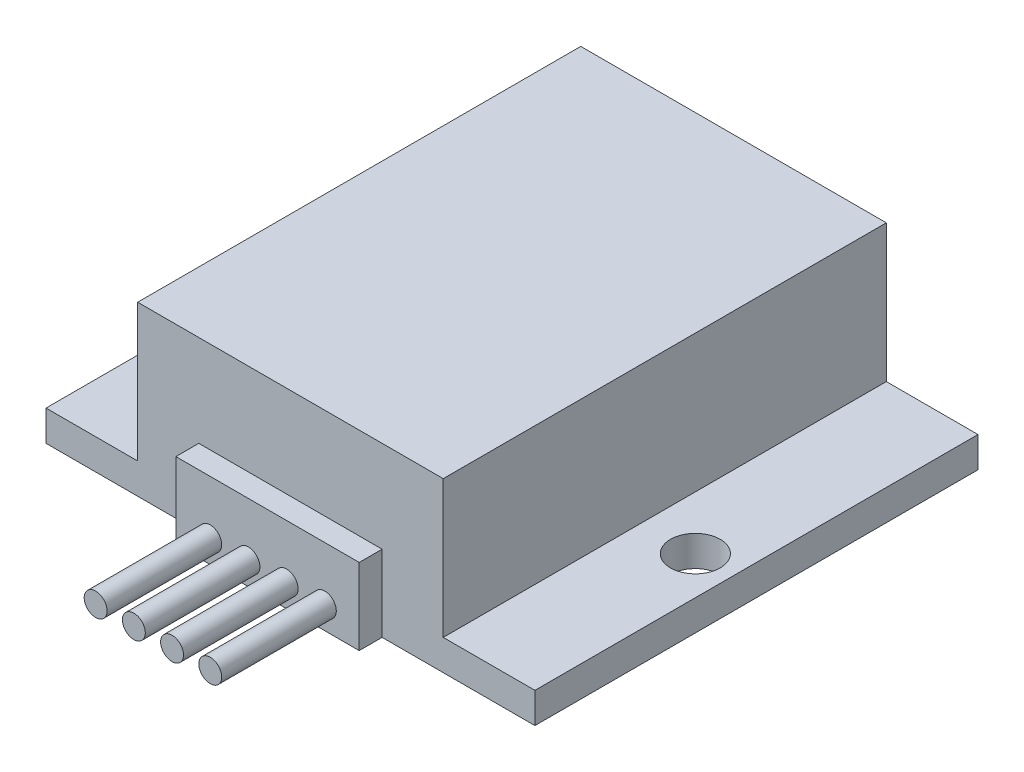
ISO-10303-21;
HEADER;
FILE_DESCRIPTION(('STEP AP214'),'2;1');
FILE_NAME('part.step','',(''),(''),'','','');
FILE_SCHEMA(('AUTOMOTIVE_DESIGN { 1 0 10303 214 1 1 1 1 }'));
ENDSEC;
DATA;
#1=APPLICATION_CONTEXT('core data for automotive mechanical design processes');
#2=APPLICATION_PROTOCOL_DEFINITION('international standard','automotive_design',2000,#1);
#3=PRODUCT_CONTEXT('',#1,'mechanical');
#4=PRODUCT('Part','Part','',(#3));
#5=PRODUCT_RELATED_PRODUCT_CATEGORY('part','',(#4));
#6=PRODUCT_DEFINITION_FORMATION('','',#4);
#7=PRODUCT_DEFINITION_CONTEXT('part definition',#1,'design');
#8=PRODUCT_DEFINITION('design','',#6,#7);
#9=PRODUCT_DEFINITION_SHAPE('','',#8);
#10=(LENGTH_UNIT() NAMED_UNIT(*) SI_UNIT(.MILLI.,.METRE.));
#11=(NAMED_UNIT(*) PLANE_ANGLE_UNIT() SI_UNIT($,.RADIAN.));
#12=(NAMED_UNIT(*) SI_UNIT($,.STERADIAN.) SOLID_ANGLE_UNIT());
#13=UNCERTAINTY_MEASURE_WITH_UNIT(LENGTH_MEASURE(1.E-05),#10,'distance_accuracy_value','');
#14=(GEOMETRIC_REPRESENTATION_CONTEXT(3) GLOBAL_UNCERTAINTY_ASSIGNED_CONTEXT((#13)) GLOBAL_UNIT_ASSIGNED_CONTEXT((#10,
#11,#12)) REPRESENTATION_CONTEXT('',''));
#15=CARTESIAN_POINT('',(0.,0.,0.));
#16=DIRECTION('',(0.,0.,1.));
#17=DIRECTION('',(1.,0.,0.));
#18=AXIS2_PLACEMENT_3D('',#15,#16,#17);
#19=CARTESIAN_POINT('',(0.,4.,29.));
#20=DIRECTION('',(0.,0.,-1.));
#21=DIRECTION('',(-1.,0.,0.));
#22=AXIS2_PLACEMENT_3D('',#19,#20,#21);
#23=PLANE('',#22);
#24=DIRECTION('',(0.,-1.,0.));
#25=VECTOR('',#24,1.);
#26=CARTESIAN_POINT('',(-12.,10.,29.));
#27=LINE('',#26,#25);
#28=CARTESIAN_POINT('',(-12.,10.,29.));
#29=VERTEX_POINT('',#28);
#30=CARTESIAN_POINT('',(-12.,0.,29.));
#31=VERTEX_POINT('',#30);
#32=EDGE_CURVE('E161',#29,#31,#27,.T.);
#33=ORIENTED_EDGE('',*,*,#32,.F.);
#34=DIRECTION('',(1.,0.,0.));
#35=VECTOR('',#34,1.);
#36=CARTESIAN_POINT('',(0.,10.,29.));
#37=LINE('',#36,#35);
#38=CARTESIAN_POINT('',(12.,10.,29.));
#39=VERTEX_POINT('',#38);
#40=EDGE_CURVE('E138',#29,#39,#37,.T.);
#41=ORIENTED_EDGE('',*,*,#40,.T.);
#42=DIRECTION('',(0.,-1.,0.));
#43=VECTOR('',#42,1.);
#44=CARTESIAN_POINT('',(12.,10.,29.));
#45=LINE('',#44,#43);
#46=CARTESIAN_POINT('',(12.,0.,29.));
#47=VERTEX_POINT('',#46);
#48=EDGE_CURVE('E133',#39,#47,#45,.T.);
#49=ORIENTED_EDGE('',*,*,#48,.T.);
#50=DIRECTION('',(1.,0.,0.));
#51=VECTOR('',#50,1.);
#52=CARTESIAN_POINT('',(0.,0.,29.));
#53=LINE('',#52,#51);
#54=CARTESIAN_POINT('',(32.,0.,29.));
#55=VERTEX_POINT('',#54);
#56=EDGE_CURVE('E247',#47,#55,#53,.T.);
#57=ORIENTED_EDGE('',*,*,#56,.T.);
#58=DIRECTION('',(0.,-1.,0.));
#59=VECTOR('',#58,1.);
#60=CARTESIAN_POINT('',(32.,4.,29.));
#61=LINE('',#60,#59);
#62=CARTESIAN_POINT('',(32.,4.,29.));
#63=VERTEX_POINT('',#62);
#64=EDGE_CURVE('E189',#63,#55,#61,.T.);
#65=ORIENTED_EDGE('',*,*,#64,.F.);
#66=DIRECTION('',(1.,0.,0.));
#67=VECTOR('',#66,1.);
#68=CARTESIAN_POINT('',(0.,4.,29.));
#69=LINE('',#68,#67);
#70=CARTESIAN_POINT('',(20.,4.,29.));
#71=VERTEX_POINT('',#70);
#72=EDGE_CURVE('E175',#71,#63,#69,.T.);
#73=ORIENTED_EDGE('',*,*,#72,.F.);
#74=DIRECTION('',(0.,-1.,0.));
#75=VECTOR('',#74,1.);
#76=CARTESIAN_POINT('',(20.,22.,29.));
#77=LINE('',#76,#75);
#78=CARTESIAN_POINT('',(20.,22.,29.));
#79=VERTEX_POINT('',#78);
#80=EDGE_CURVE('E207',#79,#71,#77,.T.);
#81=ORIENTED_EDGE('',*,*,#80,.F.);
#82=DIRECTION('',(1.,0.,0.));
#83=VECTOR('',#82,1.);
#84=CARTESIAN_POINT('',(0.,22.,29.));
#85=LINE('',#84,#83);
#86=CARTESIAN_POINT('',(-20.,22.,29.));
#87=VERTEX_POINT('',#86);
#88=EDGE_CURVE('E204',#87,#79,#85,.T.);
#89=ORIENTED_EDGE('',*,*,#88,.F.);
#90=DIRECTION('',(0.,-1.,0.));
#91=VECTOR('',#90,1.);
#92=CARTESIAN_POINT('',(-20.,22.,29.));
#93=LINE('',#92,#91);
#94=CARTESIAN_POINT('',(-20.,4.,29.));
#95=VERTEX_POINT('',#94);
#96=EDGE_CURVE('E210',#87,#95,#93,.T.);
#97=ORIENTED_EDGE('',*,*,#96,.T.);
#98=DIRECTION('',(1.,0.,0.));
#99=VECTOR('',#98,1.);
#100=CARTESIAN_POINT('',(0.,4.,29.));
#101=LINE('',#100,#99);
#102=CARTESIAN_POINT('',(-32.,4.,29.));
#103=VERTEX_POINT('',#102);
#104=EDGE_CURVE('E234',#103,#95,#101,.T.);
#105=ORIENTED_EDGE('',*,*,#104,.F.);
#106=DIRECTION('',(0.,-1.,0.));
#107=VECTOR('',#106,1.);
#108=CARTESIAN_POINT('',(-32.,4.,29.));
#109=LINE('',#108,#107);
#110=CARTESIAN_POINT('',(-32.,0.,29.));
#111=VERTEX_POINT('',#110);
#112=EDGE_CURVE('E241',#103,#111,#109,.T.);
#113=ORIENTED_EDGE('',*,*,#112,.T.);
#114=EDGE_CURVE('E248',#111,#31,#53,.T.);
#115=ORIENTED_EDGE('',*,*,#114,.T.);
#116=EDGE_LOOP('',(#33,#41,#49,#57,#65,#73,#81,#89,#97,#105,#113,#115));
#117=FACE_BOUND('',#116,.T.);
#118=ADVANCED_FACE('F39',(#117),#23,.F.);
#119=CARTESIAN_POINT('',(0.,4.,-29.));
#120=DIRECTION('',(0.,0.,-1.));
#121=DIRECTION('',(-1.,0.,0.));
#122=AXIS2_PLACEMENT_3D('',#119,#120,#121);
#123=PLANE('',#122);
#124=DIRECTION('',(1.,0.,0.));
#125=VECTOR('',#124,1.);
#126=CARTESIAN_POINT('',(0.,0.,-29.));
#127=LINE('',#126,#125);
#128=CARTESIAN_POINT('',(-32.,0.,-29.));
#129=VERTEX_POINT('',#128);
#130=CARTESIAN_POINT('',(32.,0.,-29.));
#131=VERTEX_POINT('',#130);
#132=EDGE_CURVE('E221',#129,#131,#127,.T.);
#133=ORIENTED_EDGE('',*,*,#132,.F.);
#134=DIRECTION('',(0.,-1.,0.));
#135=VECTOR('',#134,1.);
#136=CARTESIAN_POINT('',(-32.,4.,-29.));
#137=LINE('',#136,#135);
#138=CARTESIAN_POINT('',(-32.,4.,-29.));
#139=VERTEX_POINT('',#138);
#140=EDGE_CURVE('E258',#139,#129,#137,.T.);
#141=ORIENTED_EDGE('',*,*,#140,.F.);
#142=DIRECTION('',(1.,0.,0.));
#143=VECTOR('',#142,1.);
#144=CARTESIAN_POINT('',(0.,4.,-29.));
#145=LINE('',#144,#143);
#146=CARTESIAN_POINT('',(-20.,4.,-29.));
#147=VERTEX_POINT('',#146);
#148=EDGE_CURVE('E226',#139,#147,#145,.T.);
#149=ORIENTED_EDGE('',*,*,#148,.T.);
#150=DIRECTION('',(0.,-1.,0.));
#151=VECTOR('',#150,1.);
#152=CARTESIAN_POINT('',(-20.,22.,-29.));
#153=LINE('',#152,#151);
#154=CARTESIAN_POINT('',(-20.,22.,-29.));
#155=VERTEX_POINT('',#154);
#156=EDGE_CURVE('E214',#155,#147,#153,.T.);
#157=ORIENTED_EDGE('',*,*,#156,.F.);
#158=DIRECTION('',(1.,0.,0.));
#159=VECTOR('',#158,1.);
#160=CARTESIAN_POINT('',(0.,22.,-29.));
#161=LINE('',#160,#159);
#162=CARTESIAN_POINT('',(20.,22.,-29.));
#163=VERTEX_POINT('',#162);
#164=EDGE_CURVE('E197',#155,#163,#161,.T.);
#165=ORIENTED_EDGE('',*,*,#164,.T.);
#166=DIRECTION('',(0.,-1.,0.));
#167=VECTOR('',#166,1.);
#168=CARTESIAN_POINT('',(20.,22.,-29.));
#169=LINE('',#168,#167);
#170=CARTESIAN_POINT('',(20.,4.,-29.));
#171=VERTEX_POINT('',#170);
#172=EDGE_CURVE('E218',#163,#171,#169,.T.);
#173=ORIENTED_EDGE('',*,*,#172,.T.);
#174=DIRECTION('',(1.,0.,0.));
#175=VECTOR('',#174,1.);
#176=CARTESIAN_POINT('',(0.,4.,-29.));
#177=LINE('',#176,#175);
#178=CARTESIAN_POINT('',(32.,4.,-29.));
#179=VERTEX_POINT('',#178);
#180=EDGE_CURVE('E169',#171,#179,#177,.T.);
#181=ORIENTED_EDGE('',*,*,#180,.T.);
#182=DIRECTION('',(0.,-1.,0.));
#183=VECTOR('',#182,1.);
#184=CARTESIAN_POINT('',(32.,4.,-29.));
#185=LINE('',#184,#183);
#186=EDGE_CURVE('E181',#179,#131,#185,.T.);
#187=ORIENTED_EDGE('',*,*,#186,.T.);
#188=EDGE_LOOP('',(#133,#141,#149,#157,#165,#173,#181,#187));
#189=FACE_BOUND('',#188,.T.);
#190=ADVANCED_FACE('F41',(#189),#123,.T.);
#191=CARTESIAN_POINT('',(-32.,4.,0.));
#192=DIRECTION('',(1.,0.,0.));
#193=DIRECTION('',(0.,0.,-1.));
#194=AXIS2_PLACEMENT_3D('',#191,#192,#193);
#195=PLANE('',#194);
#196=DIRECTION('',(0.,0.,1.));
#197=VECTOR('',#196,1.);
#198=CARTESIAN_POINT('',(-32.,0.,0.));
#199=LINE('',#198,#197);
#200=EDGE_CURVE('E244',#129,#111,#199,.T.);
#201=ORIENTED_EDGE('',*,*,#200,.T.);
#202=ORIENTED_EDGE('',*,*,#112,.F.);
#203=DIRECTION('',(0.,0.,1.));
#204=VECTOR('',#203,1.);
#205=CARTESIAN_POINT('',(-32.,4.,0.));
#206=LINE('',#205,#204);
#207=EDGE_CURVE('E231',#139,#103,#206,.T.);
#208=ORIENTED_EDGE('',*,*,#207,.F.);
#209=ORIENTED_EDGE('',*,*,#140,.T.);
#210=EDGE_LOOP('',(#201,#202,#208,#209));
#211=FACE_BOUND('',#210,.T.);
#212=ADVANCED_FACE('F304',(#211),#195,.F.);
#213=CARTESIAN_POINT('',(-27.,4.,3.));
#214=DIRECTION('',(0.,-1.,0.));
#215=DIRECTION('',(0.,0.,-1.));
#216=AXIS2_PLACEMENT_3D('',#213,#214,#215);
#217=CYLINDRICAL_SURFACE('',#216,3.25);
#218=CARTESIAN_POINT('',(-27.,4.,3.));
#219=DIRECTION('',(0.,1.,0.));
#220=DIRECTION('',(0.,0.,1.));
#221=AXIS2_PLACEMENT_3D('',#218,#219,#220);
#222=CIRCLE('',#221,3.25);
#223=CARTESIAN_POINT('',(-27.,4.,6.25));
#224=VERTEX_POINT('',#223);
#225=EDGE_CURVE('E237',#224,#224,#222,.F.);
#226=ORIENTED_EDGE('',*,*,#225,.F.);
#227=EDGE_LOOP('',(#226));
#228=FACE_BOUND('',#227,.T.);
#229=CARTESIAN_POINT('',(-27.,0.,3.));
#230=DIRECTION('',(0.,1.,0.));
#231=DIRECTION('',(0.,0.,1.));
#232=AXIS2_PLACEMENT_3D('',#229,#230,#231);
#233=CIRCLE('',#232,3.25);
#234=CARTESIAN_POINT('',(-27.,0.,6.25));
#235=VERTEX_POINT('',#234);
#236=EDGE_CURVE('E227',#235,#235,#233,.F.);
#237=ORIENTED_EDGE('',*,*,#236,.T.);
#238=EDGE_LOOP('',(#237));
#239=FACE_BOUND('',#238,.T.);
#240=ADVANCED_FACE('F308',(#228,#239),#217,.F.);
#241=CARTESIAN_POINT('',(0.,4.,0.));
#242=DIRECTION('',(0.,1.,0.));
#243=DIRECTION('',(0.,0.,1.));
#244=AXIS2_PLACEMENT_3D('',#241,#242,#243);
#245=PLANE('',#244);
#246=DIRECTION('',(0.,0.,1.));
#247=VECTOR('',#246,1.);
#248=CARTESIAN_POINT('',(-20.,4.,0.));
#249=LINE('',#248,#247);
#250=EDGE_CURVE('E222',#147,#95,#249,.T.);
#251=ORIENTED_EDGE('',*,*,#250,.F.);
#252=ORIENTED_EDGE('',*,*,#148,.F.);
#253=ORIENTED_EDGE('',*,*,#207,.T.);
#254=ORIENTED_EDGE('',*,*,#104,.T.);
#255=EDGE_LOOP('',(#251,#252,#253,#254));
#256=FACE_BOUND('',#255,.T.);
#257=ORIENTED_EDGE('',*,*,#225,.T.);
#258=EDGE_LOOP('',(#257));
#259=FACE_BOUND('',#258,.T.);
#260=ADVANCED_FACE('F315',(#256,#259),#245,.T.);
#261=CARTESIAN_POINT('',(0.,0.,0.));
#262=DIRECTION('',(0.,1.,0.));
#263=DIRECTION('',(0.,0.,1.));
#264=AXIS2_PLACEMENT_3D('',#261,#262,#263);
#265=PLANE('',#264);
#266=ORIENTED_EDGE('',*,*,#132,.T.);
#267=DIRECTION('',(0.,0.,1.));
#268=VECTOR('',#267,1.);
#269=CARTESIAN_POINT('',(32.,0.,0.));
#270=LINE('',#269,#268);
#271=EDGE_CURVE('E159',#131,#55,#270,.T.);
#272=ORIENTED_EDGE('',*,*,#271,.T.);
#273=ORIENTED_EDGE('',*,*,#56,.F.);
#274=DIRECTION('',(0.,0.,-1.));
#275=VECTOR('',#274,1.);
#276=CARTESIAN_POINT('',(11.9999999999999,0.,0.));
#277=LINE('',#276,#275);
#278=CARTESIAN_POINT('',(12.,0.,32.));
#279=VERTEX_POINT('',#278);
#280=EDGE_CURVE('E55',#279,#47,#277,.T.);
#281=ORIENTED_EDGE('',*,*,#280,.F.);
#282=DIRECTION('',(1.,0.,0.));
#283=VECTOR('',#282,1.);
#284=CARTESIAN_POINT('',(0.,0.,32.));
#285=LINE('',#284,#283);
#286=CARTESIAN_POINT('',(-12.,0.,32.));
#287=VERTEX_POINT('',#286);
#288=EDGE_CURVE('E152',#287,#279,#285,.T.);
#289=ORIENTED_EDGE('',*,*,#288,.F.);
#290=DIRECTION('',(0.,0.,1.));
#291=VECTOR('',#290,1.);
#292=CARTESIAN_POINT('',(-12.,0.,0.));
#293=LINE('',#292,#291);
#294=EDGE_CURVE('E148',#31,#287,#293,.T.);
#295=ORIENTED_EDGE('',*,*,#294,.F.);
#296=ORIENTED_EDGE('',*,*,#114,.F.);
#297=ORIENTED_EDGE('',*,*,#200,.F.);
#298=EDGE_LOOP('',(#266,#272,#273,#281,#289,#295,#296,#297));
#299=FACE_BOUND('',#298,.T.);
#300=ORIENTED_EDGE('',*,*,#236,.F.);
#301=EDGE_LOOP('',(#300));
#302=FACE_BOUND('',#301,.T.);
#303=CARTESIAN_POINT('',(27.,0.,3.));
#304=DIRECTION('',(0.,1.,0.));
#305=DIRECTION('',(0.,0.,1.));
#306=AXIS2_PLACEMENT_3D('',#303,#304,#305);
#307=CIRCLE('',#306,3.25);
#308=CARTESIAN_POINT('',(27.,0.,6.25));
#309=VERTEX_POINT('',#308);
#310=EDGE_CURVE('E154',#309,#309,#307,.T.);
#311=ORIENTED_EDGE('',*,*,#310,.T.);
#312=EDGE_LOOP('',(#311));
#313=FACE_BOUND('',#312,.T.);
#314=ADVANCED_FACE('F325',(#299,#302,#313),#265,.F.);
#315=CARTESIAN_POINT('',(-20.,22.,0.));
#316=DIRECTION('',(1.,0.,0.));
#317=DIRECTION('',(0.,0.,-1.));
#318=AXIS2_PLACEMENT_3D('',#315,#316,#317);
#319=PLANE('',#318);
#320=ORIENTED_EDGE('',*,*,#156,.T.);
#321=ORIENTED_EDGE('',*,*,#250,.T.);
#322=ORIENTED_EDGE('',*,*,#96,.F.);
#323=DIRECTION('',(0.,0.,1.));
#324=VECTOR('',#323,1.);
#325=CARTESIAN_POINT('',(-20.,22.,0.));
#326=LINE('',#325,#324);
#327=EDGE_CURVE('E201',#155,#87,#326,.T.);
#328=ORIENTED_EDGE('',*,*,#327,.F.);
#329=EDGE_LOOP('',(#320,#321,#322,#328));
#330=FACE_BOUND('',#329,.T.);
#331=ADVANCED_FACE('F463',(#330),#319,.F.);
#332=CARTESIAN_POINT('',(20.,22.,0.));
#333=DIRECTION('',(1.,0.,0.));
#334=DIRECTION('',(0.,0.,-1.));
#335=AXIS2_PLACEMENT_3D('',#332,#333,#334);
#336=PLANE('',#335);
#337=DIRECTION('',(0.,0.,1.));
#338=VECTOR('',#337,1.);
#339=CARTESIAN_POINT('',(20.,4.,0.));
#340=LINE('',#339,#338);
#341=EDGE_CURVE('E63',#171,#71,#340,.T.);
#342=ORIENTED_EDGE('',*,*,#341,.F.);
#343=ORIENTED_EDGE('',*,*,#172,.F.);
#344=DIRECTION('',(0.,0.,1.));
#345=VECTOR('',#344,1.);
#346=CARTESIAN_POINT('',(20.,22.,0.));
#347=LINE('',#346,#345);
#348=EDGE_CURVE('E193',#163,#79,#347,.T.);
#349=ORIENTED_EDGE('',*,*,#348,.T.);
#350=ORIENTED_EDGE('',*,*,#80,.T.);
#351=EDGE_LOOP('',(#342,#343,#349,#350));
#352=FACE_BOUND('',#351,.T.);
#353=ADVANCED_FACE('F514',(#352),#336,.T.);
#354=CARTESIAN_POINT('',(0.,22.,0.));
#355=DIRECTION('',(0.,1.,0.));
#356=DIRECTION('',(0.,0.,1.));
#357=AXIS2_PLACEMENT_3D('',#354,#355,#356);
#358=PLANE('',#357);
#359=ORIENTED_EDGE('',*,*,#348,.F.);
#360=ORIENTED_EDGE('',*,*,#164,.F.);
#361=ORIENTED_EDGE('',*,*,#327,.T.);
#362=ORIENTED_EDGE('',*,*,#88,.T.);
#363=EDGE_LOOP('',(#359,#360,#361,#362));
#364=FACE_BOUND('',#363,.T.);
#365=ADVANCED_FACE('F503',(#364),#358,.T.);
#366=CARTESIAN_POINT('',(27.,4.,3.));
#367=DIRECTION('',(0.,-1.,0.));
#368=DIRECTION('',(0.,0.,-1.));
#369=AXIS2_PLACEMENT_3D('',#366,#367,#368);
#370=CYLINDRICAL_SURFACE('',#369,3.25);
#371=CARTESIAN_POINT('',(27.,4.,3.));
#372=DIRECTION('',(0.,1.,0.));
#373=DIRECTION('',(0.,0.,1.));
#374=AXIS2_PLACEMENT_3D('',#371,#372,#373);
#375=CIRCLE('',#374,3.25);
#376=CARTESIAN_POINT('',(27.,4.,6.25));
#377=VERTEX_POINT('',#376);
#378=EDGE_CURVE('E165',#377,#377,#375,.T.);
#379=ORIENTED_EDGE('',*,*,#378,.T.);
#380=EDGE_LOOP('',(#379));
#381=FACE_BOUND('',#380,.T.);
#382=ORIENTED_EDGE('',*,*,#310,.F.);
#383=EDGE_LOOP('',(#382));
#384=FACE_BOUND('',#383,.T.);
#385=ADVANCED_FACE('F493',(#381,#384),#370,.F.);
#386=CARTESIAN_POINT('',(32.,4.,0.));
#387=DIRECTION('',(1.,0.,0.));
#388=DIRECTION('',(0.,0.,-1.));
#389=AXIS2_PLACEMENT_3D('',#386,#387,#388);
#390=PLANE('',#389);
#391=ORIENTED_EDGE('',*,*,#271,.F.);
#392=ORIENTED_EDGE('',*,*,#186,.F.);
#393=DIRECTION('',(0.,0.,1.));
#394=VECTOR('',#393,1.);
#395=CARTESIAN_POINT('',(32.,4.,0.));
#396=LINE('',#395,#394);
#397=EDGE_CURVE('E178',#179,#63,#396,.T.);
#398=ORIENTED_EDGE('',*,*,#397,.T.);
#399=ORIENTED_EDGE('',*,*,#64,.T.);
#400=EDGE_LOOP('',(#391,#392,#398,#399));
#401=FACE_BOUND('',#400,.T.);
#402=ADVANCED_FACE('F482',(#401),#390,.T.);
#403=CARTESIAN_POINT('',(0.,4.,0.));
#404=DIRECTION('',(0.,1.,0.));
#405=DIRECTION('',(0.,0.,1.));
#406=AXIS2_PLACEMENT_3D('',#403,#404,#405);
#407=PLANE('',#406);
#408=ORIENTED_EDGE('',*,*,#378,.F.);
#409=EDGE_LOOP('',(#408));
#410=FACE_BOUND('',#409,.T.);
#411=ORIENTED_EDGE('',*,*,#180,.F.);
#412=ORIENTED_EDGE('',*,*,#341,.T.);
#413=ORIENTED_EDGE('',*,*,#72,.T.);
#414=ORIENTED_EDGE('',*,*,#397,.F.);
#415=EDGE_LOOP('',(#411,#412,#413,#414));
#416=FACE_BOUND('',#415,.T.);
#417=ADVANCED_FACE('F276',(#410,#416),#407,.T.);
#418=CARTESIAN_POINT('',(0.,10.,32.));
#419=DIRECTION('',(0.,0.,-1.));
#420=DIRECTION('',(-1.,0.,0.));
#421=AXIS2_PLACEMENT_3D('',#418,#419,#420);
#422=PLANE('',#421);
#423=CARTESIAN_POINT('',(7.50000000000001,3.,32.));
#424=DIRECTION('',(0.,0.,-1.));
#425=DIRECTION('',(-1.,0.,0.));
#426=AXIS2_PLACEMENT_3D('',#423,#424,#425);
#427=CIRCLE('',#426,1.5);
#428=CARTESIAN_POINT('',(6.00000000000001,3.,32.));
#429=VERTEX_POINT('',#428);
#430=EDGE_CURVE('E11',#429,#429,#427,.F.);
#431=ORIENTED_EDGE('',*,*,#430,.F.);
#432=EDGE_LOOP('',(#431));
#433=FACE_BOUND('',#432,.T.);
#434=CARTESIAN_POINT('',(2.50000000000001,3.,32.));
#435=DIRECTION('',(0.,0.,-1.));
#436=DIRECTION('',(-1.,0.,0.));
#437=AXIS2_PLACEMENT_3D('',#434,#435,#436);
#438=CIRCLE('',#437,1.5);
#439=CARTESIAN_POINT('',(1.00000000000001,3.,32.));
#440=VERTEX_POINT('',#439);
#441=EDGE_CURVE('E48',#440,#440,#438,.F.);
#442=ORIENTED_EDGE('',*,*,#441,.F.);
#443=EDGE_LOOP('',(#442));
#444=FACE_BOUND('',#443,.T.);
#445=CARTESIAN_POINT('',(-2.49999999999999,3.,32.));
#446=DIRECTION('',(0.,0.,-1.));
#447=DIRECTION('',(-1.,0.,0.));
#448=AXIS2_PLACEMENT_3D('',#445,#446,#447);
#449=CIRCLE('',#448,1.5);
#450=CARTESIAN_POINT('',(-3.99999999999999,3.,32.));
#451=VERTEX_POINT('',#450);
#452=EDGE_CURVE('E265',#451,#451,#449,.F.);
#453=ORIENTED_EDGE('',*,*,#452,.F.);
#454=EDGE_LOOP('',(#453));
#455=FACE_BOUND('',#454,.T.);
#456=CARTESIAN_POINT('',(-7.49999999999999,3.,32.));
#457=DIRECTION('',(0.,0.,-1.));
#458=DIRECTION('',(-1.,0.,0.));
#459=AXIS2_PLACEMENT_3D('',#456,#457,#458);
#460=CIRCLE('',#459,1.5);
#461=CARTESIAN_POINT('',(-8.99999999999999,3.,32.));
#462=VERTEX_POINT('',#461);
#463=EDGE_CURVE('E261',#462,#462,#460,.F.);
#464=ORIENTED_EDGE('',*,*,#463,.F.);
#465=EDGE_LOOP('',(#464));
#466=FACE_BOUND('',#465,.T.);
#467=ORIENTED_EDGE('',*,*,#288,.T.);
#468=DIRECTION('',(0.,-1.,0.));
#469=VECTOR('',#468,1.);
#470=CARTESIAN_POINT('',(12.,10.,32.));
#471=LINE('',#470,#469);
#472=CARTESIAN_POINT('',(12.,10.,32.));
#473=VERTEX_POINT('',#472);
#474=EDGE_CURVE('E131',#473,#279,#471,.T.);
#475=ORIENTED_EDGE('',*,*,#474,.F.);
#476=DIRECTION('',(1.,0.,0.));
#477=VECTOR('',#476,1.);
#478=CARTESIAN_POINT('',(0.,10.,32.));
#479=LINE('',#478,#477);
#480=CARTESIAN_POINT('',(-12.,10.,32.));
#481=VERTEX_POINT('',#480);
#482=EDGE_CURVE('E139',#481,#473,#479,.T.);
#483=ORIENTED_EDGE('',*,*,#482,.F.);
#484=DIRECTION('',(0.,-1.,0.));
#485=VECTOR('',#484,1.);
#486=CARTESIAN_POINT('',(-12.,10.,32.));
#487=LINE('',#486,#485);
#488=EDGE_CURVE('E334',#481,#287,#487,.T.);
#489=ORIENTED_EDGE('',*,*,#488,.T.);
#490=EDGE_LOOP('',(#467,#475,#483,#489));
#491=FACE_BOUND('',#490,.T.);
#492=ADVANCED_FACE('F150',(#433,#444,#455,#466,#491),#422,.F.);
#493=CARTESIAN_POINT('',(11.9999999999999,10.,0.));
#494=DIRECTION('',(-1.,0.,0.));
#495=DIRECTION('',(0.,0.,1.));
#496=AXIS2_PLACEMENT_3D('',#493,#494,#495);
#497=PLANE('',#496);
#498=ORIENTED_EDGE('',*,*,#280,.T.);
#499=ORIENTED_EDGE('',*,*,#48,.F.);
#500=DIRECTION('',(0.,0.,-1.));
#501=VECTOR('',#500,1.);
#502=CARTESIAN_POINT('',(11.9999999999999,10.,0.));
#503=LINE('',#502,#501);
#504=EDGE_CURVE('E127',#473,#39,#503,.T.);
#505=ORIENTED_EDGE('',*,*,#504,.F.);
#506=ORIENTED_EDGE('',*,*,#474,.T.);
#507=EDGE_LOOP('',(#498,#499,#505,#506));
#508=FACE_BOUND('',#507,.T.);
#509=ADVANCED_FACE('F129',(#508),#497,.F.);
#510=CARTESIAN_POINT('',(-12.,10.,0.));
#511=DIRECTION('',(1.,0.,0.));
#512=DIRECTION('',(0.,0.,-1.));
#513=AXIS2_PLACEMENT_3D('',#510,#511,#512);
#514=PLANE('',#513);
#515=ORIENTED_EDGE('',*,*,#294,.T.);
#516=ORIENTED_EDGE('',*,*,#488,.F.);
#517=DIRECTION('',(0.,0.,1.));
#518=VECTOR('',#517,1.);
#519=CARTESIAN_POINT('',(-12.,10.,0.));
#520=LINE('',#519,#518);
#521=EDGE_CURVE('E143',#29,#481,#520,.T.);
#522=ORIENTED_EDGE('',*,*,#521,.F.);
#523=ORIENTED_EDGE('',*,*,#32,.T.);
#524=EDGE_LOOP('',(#515,#516,#522,#523));
#525=FACE_BOUND('',#524,.T.);
#526=ADVANCED_FACE('F295',(#525),#514,.F.);
#527=CARTESIAN_POINT('',(0.,10.,0.));
#528=DIRECTION('',(0.,1.,0.));
#529=DIRECTION('',(0.,0.,1.));
#530=AXIS2_PLACEMENT_3D('',#527,#528,#529);
#531=PLANE('',#530);
#532=ORIENTED_EDGE('',*,*,#482,.T.);
#533=ORIENTED_EDGE('',*,*,#504,.T.);
#534=ORIENTED_EDGE('',*,*,#40,.F.);
#535=ORIENTED_EDGE('',*,*,#521,.T.);
#536=EDGE_LOOP('',(#532,#533,#534,#535));
#537=FACE_BOUND('',#536,.T.);
#538=ADVANCED_FACE('F142',(#537),#531,.T.);
#539=CARTESIAN_POINT('',(-7.49999999999999,3.,47.));
#540=DIRECTION('',(0.,0.,-1.));
#541=DIRECTION('',(-1.,0.,0.));
#542=AXIS2_PLACEMENT_3D('',#539,#540,#541);
#543=CYLINDRICAL_SURFACE('',#542,1.5);
#544=CARTESIAN_POINT('',(-7.49999999999999,3.,47.));
#545=DIRECTION('',(0.,0.,1.));
#546=DIRECTION('',(1.,0.,0.));
#547=AXIS2_PLACEMENT_3D('',#544,#545,#546);
#548=CIRCLE('',#547,1.5);
#549=CARTESIAN_POINT('',(-5.99999999999999,3.,47.));
#550=VERTEX_POINT('',#549);
#551=EDGE_CURVE('E343',#550,#550,#548,.T.);
#552=ORIENTED_EDGE('',*,*,#551,.F.);
#553=EDGE_LOOP('',(#552));
#554=FACE_BOUND('',#553,.T.);
#555=ORIENTED_EDGE('',*,*,#463,.T.);
#556=EDGE_LOOP('',(#555));
#557=FACE_BOUND('',#556,.T.);
#558=ADVANCED_FACE('F283',(#554,#557),#543,.T.);
#559=CARTESIAN_POINT('',(-7.49999999999999,3.,47.));
#560=DIRECTION('',(0.,0.,1.));
#561=DIRECTION('',(1.,0.,0.));
#562=AXIS2_PLACEMENT_3D('',#559,#560,#561);
#563=PLANE('',#562);
#564=ORIENTED_EDGE('',*,*,#551,.T.);
#565=EDGE_LOOP('',(#564));
#566=FACE_BOUND('',#565,.T.);
#567=ADVANCED_FACE('F285',(#566),#563,.T.);
#568=CARTESIAN_POINT('',(-2.49999999999999,3.,47.));
#569=DIRECTION('',(0.,0.,-1.));
#570=DIRECTION('',(-1.,0.,0.));
#571=AXIS2_PLACEMENT_3D('',#568,#569,#570);
#572=CYLINDRICAL_SURFACE('',#571,1.5);
#573=CARTESIAN_POINT('',(-2.49999999999999,3.,47.));
#574=DIRECTION('',(0.,0.,1.));
#575=DIRECTION('',(1.,0.,0.));
#576=AXIS2_PLACEMENT_3D('',#573,#574,#575);
#577=CIRCLE('',#576,1.5);
#578=CARTESIAN_POINT('',(-0.999999999999991,3.,47.));
#579=VERTEX_POINT('',#578);
#580=EDGE_CURVE('E346',#579,#579,#577,.T.);
#581=ORIENTED_EDGE('',*,*,#580,.F.);
#582=EDGE_LOOP('',(#581));
#583=FACE_BOUND('',#582,.T.);
#584=ORIENTED_EDGE('',*,*,#452,.T.);
#585=EDGE_LOOP('',(#584));
#586=FACE_BOUND('',#585,.T.);
#587=ADVANCED_FACE('F292',(#583,#586),#572,.T.);
#588=CARTESIAN_POINT('',(-2.49999999999999,3.,47.));
#589=DIRECTION('',(0.,0.,1.));
#590=DIRECTION('',(1.,0.,0.));
#591=AXIS2_PLACEMENT_3D('',#588,#589,#590);
#592=PLANE('',#591);
#593=ORIENTED_EDGE('',*,*,#580,.T.);
#594=EDGE_LOOP('',(#593));
#595=FACE_BOUND('',#594,.T.);
#596=ADVANCED_FACE('F379',(#595),#592,.T.);
#597=CARTESIAN_POINT('',(2.50000000000001,3.,47.));
#598=DIRECTION('',(0.,0.,-1.));
#599=DIRECTION('',(-1.,0.,0.));
#600=AXIS2_PLACEMENT_3D('',#597,#598,#599);
#601=CYLINDRICAL_SURFACE('',#600,1.5);
#602=CARTESIAN_POINT('',(2.50000000000001,3.,47.));
#603=DIRECTION('',(0.,0.,1.));
#604=DIRECTION('',(1.,0.,0.));
#605=AXIS2_PLACEMENT_3D('',#602,#603,#604);
#606=CIRCLE('',#605,1.5);
#607=CARTESIAN_POINT('',(4.00000000000001,3.,47.));
#608=VERTEX_POINT('',#607);
#609=EDGE_CURVE('E350',#608,#608,#606,.T.);
#610=ORIENTED_EDGE('',*,*,#609,.F.);
#611=EDGE_LOOP('',(#610));
#612=FACE_BOUND('',#611,.T.);
#613=ORIENTED_EDGE('',*,*,#441,.T.);
#614=EDGE_LOOP('',(#613));
#615=FACE_BOUND('',#614,.T.);
#616=ADVANCED_FACE('F272',(#612,#615),#601,.T.);
#617=CARTESIAN_POINT('',(2.50000000000001,3.,47.));
#618=DIRECTION('',(0.,0.,1.));
#619=DIRECTION('',(1.,0.,0.));
#620=AXIS2_PLACEMENT_3D('',#617,#618,#619);
#621=PLANE('',#620);
#622=ORIENTED_EDGE('',*,*,#609,.T.);
#623=EDGE_LOOP('',(#622));
#624=FACE_BOUND('',#623,.T.);
#625=ADVANCED_FACE('F366',(#624),#621,.T.);
#626=CARTESIAN_POINT('',(7.50000000000001,3.,47.));
#627=DIRECTION('',(0.,0.,-1.));
#628=DIRECTION('',(-1.,0.,0.));
#629=AXIS2_PLACEMENT_3D('',#626,#627,#628);
#630=CYLINDRICAL_SURFACE('',#629,1.5);
#631=CARTESIAN_POINT('',(7.50000000000001,3.,47.));
#632=DIRECTION('',(0.,0.,1.));
#633=DIRECTION('',(1.,0.,0.));
#634=AXIS2_PLACEMENT_3D('',#631,#632,#633);
#635=CIRCLE('',#634,1.5);
#636=CARTESIAN_POINT('',(9.00000000000001,3.,47.));
#637=VERTEX_POINT('',#636);
#638=EDGE_CURVE('E356',#637,#637,#635,.T.);
#639=ORIENTED_EDGE('',*,*,#638,.F.);
#640=EDGE_LOOP('',(#639));
#641=FACE_BOUND('',#640,.T.);
#642=ORIENTED_EDGE('',*,*,#430,.T.);
#643=EDGE_LOOP('',(#642));
#644=FACE_BOUND('',#643,.T.);
#645=ADVANCED_FACE('F363',(#641,#644),#630,.T.);
#646=CARTESIAN_POINT('',(7.50000000000001,3.,47.));
#647=DIRECTION('',(0.,0.,1.));
#648=DIRECTION('',(1.,0.,0.));
#649=AXIS2_PLACEMENT_3D('',#646,#647,#648);
#650=PLANE('',#649);
#651=ORIENTED_EDGE('',*,*,#638,.T.);
#652=EDGE_LOOP('',(#651));
#653=FACE_BOUND('',#652,.T.);
#654=ADVANCED_FACE('F361',(#653),#650,.T.);
#655=CLOSED_SHELL('',(#118,#190,#212,#240,#260,#314,#331,#353,#365,#385,#402,#417,#492,#509,
#526,#538,#558,#567,#587,#596,#616,#625,#645,#654));
#656=MANIFOLD_SOLID_BREP('B2',#655);
#657=ADVANCED_BREP_SHAPE_REPRESENTATION('',(#18,#656),#14);
#658=SHAPE_DEFINITION_REPRESENTATION(#9,#657);
ENDSEC;
END-ISO-10303-21;
